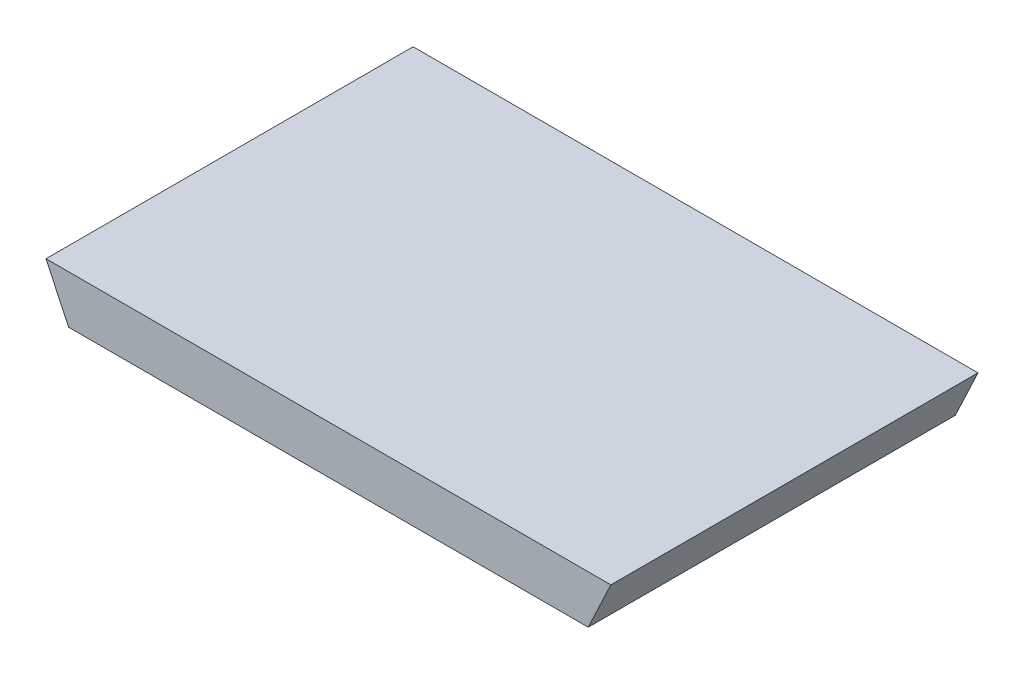
ISO-10303-21;
HEADER;
FILE_DESCRIPTION(('STEP AP214'),'2;1');
FILE_NAME('part.step','',(''),(''),'','','');
FILE_SCHEMA(('AUTOMOTIVE_DESIGN { 1 0 10303 214 1 1 1 1 }'));
ENDSEC;
DATA;
#1=APPLICATION_CONTEXT('core data for automotive mechanical design processes');
#2=APPLICATION_PROTOCOL_DEFINITION('international standard','automotive_design',2000,#1);
#3=PRODUCT_CONTEXT('',#1,'mechanical');
#4=PRODUCT('Part','Part','',(#3));
#5=PRODUCT_RELATED_PRODUCT_CATEGORY('part','',(#4));
#6=PRODUCT_DEFINITION_FORMATION('','',#4);
#7=PRODUCT_DEFINITION_CONTEXT('part definition',#1,'design');
#8=PRODUCT_DEFINITION('design','',#6,#7);
#9=PRODUCT_DEFINITION_SHAPE('','',#8);
#10=(LENGTH_UNIT() NAMED_UNIT(*) SI_UNIT(.MILLI.,.METRE.));
#11=(NAMED_UNIT(*) PLANE_ANGLE_UNIT() SI_UNIT($,.RADIAN.));
#12=(NAMED_UNIT(*) SI_UNIT($,.STERADIAN.) SOLID_ANGLE_UNIT());
#13=UNCERTAINTY_MEASURE_WITH_UNIT(LENGTH_MEASURE(1.E-05),#10,'distance_accuracy_value','');
#14=(GEOMETRIC_REPRESENTATION_CONTEXT(3) GLOBAL_UNCERTAINTY_ASSIGNED_CONTEXT((#13)) GLOBAL_UNIT_ASSIGNED_CONTEXT((#10,
#11,#12)) REPRESENTATION_CONTEXT('',''));
#15=CARTESIAN_POINT('',(0.,0.,0.));
#16=DIRECTION('',(0.,0.,1.));
#17=DIRECTION('',(1.,0.,0.));
#18=AXIS2_PLACEMENT_3D('',#15,#16,#17);
#19=CARTESIAN_POINT('',(0.9200007,-0.08499856,0.));
#20=DIRECTION('',(0.,-1.,0.));
#21=DIRECTION('',(0.,0.,-1.));
#22=AXIS2_PLACEMENT_3D('',#19,#20,#21);
#23=PLANE('',#22);
#24=DIRECTION('',(0.,0.,1.));
#25=VECTOR('',#24,1.);
#26=CARTESIAN_POINT('',(-0.9200007,-0.08499856,0.));
#27=LINE('',#26,#25);
#28=CARTESIAN_POINT('',(-0.9200007,-0.08499856,0.));
#29=VERTEX_POINT('',#28);
#30=CARTESIAN_POINT('',(-0.9200007,-0.08499856,1.29999994));
#31=VERTEX_POINT('',#30);
#32=EDGE_CURVE('E19',#29,#31,#27,.T.);
#33=ORIENTED_EDGE('',*,*,#32,.F.);
#34=DIRECTION('',(1.,0.,0.));
#35=VECTOR('',#34,1.);
#36=CARTESIAN_POINT('',(-1.00000054,-0.08499856,0.));
#37=LINE('',#36,#35);
#38=CARTESIAN_POINT('',(0.920000699999995,-0.0849985599999979,0.));
#39=VERTEX_POINT('',#38);
#40=EDGE_CURVE('E79',#29,#39,#37,.T.);
#41=ORIENTED_EDGE('',*,*,#40,.T.);
#42=DIRECTION('',(0.,0.,1.));
#43=VECTOR('',#42,1.);
#44=CARTESIAN_POINT('',(0.920000699999982,-0.0849985599999915,0.));
#45=LINE('',#44,#43);
#46=CARTESIAN_POINT('',(0.920000699999995,-0.0849985599999979,1.29999994));
#47=VERTEX_POINT('',#46);
#48=EDGE_CURVE('E67',#47,#39,#45,.F.);
#49=ORIENTED_EDGE('',*,*,#48,.F.);
#50=DIRECTION('',(1.,0.,0.));
#51=VECTOR('',#50,1.);
#52=CARTESIAN_POINT('',(-1.00000054,-0.08499856,1.29999994));
#53=LINE('',#52,#51);
#54=EDGE_CURVE('E55',#31,#47,#53,.T.);
#55=ORIENTED_EDGE('',*,*,#54,.F.);
#56=EDGE_LOOP('',(#33,#41,#49,#55));
#57=FACE_BOUND('',#56,.T.);
#58=ADVANCED_FACE('F16',(#57),#23,.T.);
#59=CARTESIAN_POINT('',(-0.9200007,-0.08499856,0.));
#60=DIRECTION('',(-0.904818702200949,-0.425797036329976,0.));
#61=DIRECTION('',(0.425797036329976,-0.904818702200949,0.));
#62=AXIS2_PLACEMENT_3D('',#59,#60,#61);
#63=PLANE('',#62);
#64=DIRECTION('',(0.,0.,1.));
#65=VECTOR('',#64,1.);
#66=CARTESIAN_POINT('',(-1.00000054,0.0850011,0.));
#67=LINE('',#66,#65);
#68=CARTESIAN_POINT('',(-1.00000054000001,0.0850010999999958,0.));
#69=VERTEX_POINT('',#68);
#70=CARTESIAN_POINT('',(-1.00000054000001,0.0850010999999958,1.29999994));
#71=VERTEX_POINT('',#70);
#72=EDGE_CURVE('E82',#69,#71,#67,.T.);
#73=ORIENTED_EDGE('',*,*,#72,.F.);
#74=DIRECTION('',(0.425797036329879,-0.904818702200994,0.));
#75=VECTOR('',#74,1.);
#76=CARTESIAN_POINT('',(-1.00000054,0.0850011,0.));
#77=LINE('',#76,#75);
#78=EDGE_CURVE('E64',#69,#29,#77,.T.);
#79=ORIENTED_EDGE('',*,*,#78,.T.);
#80=ORIENTED_EDGE('',*,*,#32,.T.);
#81=DIRECTION('',(0.425797036329879,-0.904818702200994,0.));
#82=VECTOR('',#81,1.);
#83=CARTESIAN_POINT('',(-1.00000054,0.0850011,1.29999994));
#84=LINE('',#83,#82);
#85=EDGE_CURVE('E61',#71,#31,#84,.T.);
#86=ORIENTED_EDGE('',*,*,#85,.F.);
#87=EDGE_LOOP('',(#73,#79,#80,#86));
#88=FACE_BOUND('',#87,.T.);
#89=ADVANCED_FACE('F60',(#88),#63,.T.);
#90=CARTESIAN_POINT('',(-1.00000054,0.0850011,1.29999994));
#91=DIRECTION('',(0.,0.,1.));
#92=DIRECTION('',(1.,0.,0.));
#93=AXIS2_PLACEMENT_3D('',#90,#91,#92);
#94=PLANE('',#93);
#95=DIRECTION('',(0.425797036329976,0.904818702200949,0.));
#96=VECTOR('',#95,1.);
#97=CARTESIAN_POINT('',(1.00000054,0.0850011,1.29999994));
#98=LINE('',#97,#96);
#99=CARTESIAN_POINT('',(1.00000054,0.0850011,1.29999994));
#100=VERTEX_POINT('',#99);
#101=EDGE_CURVE('E69',#100,#47,#98,.F.);
#102=ORIENTED_EDGE('',*,*,#101,.F.);
#103=DIRECTION('',(1.,0.,0.));
#104=VECTOR('',#103,1.);
#105=CARTESIAN_POINT('',(-1.00000054,0.0850011,1.29999994));
#106=LINE('',#105,#104);
#107=EDGE_CURVE('E73',#71,#100,#106,.T.);
#108=ORIENTED_EDGE('',*,*,#107,.F.);
#109=ORIENTED_EDGE('',*,*,#85,.T.);
#110=ORIENTED_EDGE('',*,*,#54,.T.);
#111=EDGE_LOOP('',(#102,#108,#109,#110));
#112=FACE_BOUND('',#111,.T.);
#113=ADVANCED_FACE('F71',(#112),#94,.T.);
#114=CARTESIAN_POINT('',(1.00000054,0.0850011,0.));
#115=DIRECTION('',(0.904818702200949,-0.425797036329976,0.));
#116=DIRECTION('',(0.425797036329976,0.904818702200949,0.));
#117=AXIS2_PLACEMENT_3D('',#114,#115,#116);
#118=PLANE('',#117);
#119=ORIENTED_EDGE('',*,*,#48,.T.);
#120=DIRECTION('',(0.425797036329879,0.904818702200994,0.));
#121=VECTOR('',#120,1.);
#122=CARTESIAN_POINT('',(0.9200007,-0.08499856,0.));
#123=LINE('',#122,#121);
#124=CARTESIAN_POINT('',(1.00000054,0.0850011,0.));
#125=VERTEX_POINT('',#124);
#126=EDGE_CURVE('E34',#39,#125,#123,.T.);
#127=ORIENTED_EDGE('',*,*,#126,.T.);
#128=DIRECTION('',(0.,0.,1.));
#129=VECTOR('',#128,1.);
#130=CARTESIAN_POINT('',(1.00000054,0.0850011,0.));
#131=LINE('',#130,#129);
#132=EDGE_CURVE('E25',#100,#125,#131,.F.);
#133=ORIENTED_EDGE('',*,*,#132,.F.);
#134=ORIENTED_EDGE('',*,*,#101,.T.);
#135=EDGE_LOOP('',(#119,#127,#133,#134));
#136=FACE_BOUND('',#135,.T.);
#137=ADVANCED_FACE('F88',(#136),#118,.T.);
#138=CARTESIAN_POINT('',(-1.00000054,0.0850011,0.));
#139=DIRECTION('',(0.,0.,1.));
#140=DIRECTION('',(1.,0.,0.));
#141=AXIS2_PLACEMENT_3D('',#138,#139,#140);
#142=PLANE('',#141);
#143=ORIENTED_EDGE('',*,*,#126,.F.);
#144=ORIENTED_EDGE('',*,*,#40,.F.);
#145=ORIENTED_EDGE('',*,*,#78,.F.);
#146=DIRECTION('',(1.,0.,0.));
#147=VECTOR('',#146,1.);
#148=CARTESIAN_POINT('',(-1.00000054,0.0850011,0.));
#149=LINE('',#148,#147);
#150=EDGE_CURVE('E11',#125,#69,#149,.F.);
#151=ORIENTED_EDGE('',*,*,#150,.F.);
#152=EDGE_LOOP('',(#143,#144,#145,#151));
#153=FACE_BOUND('',#152,.T.);
#154=ADVANCED_FACE('F90',(#153),#142,.F.);
#155=CARTESIAN_POINT('',(-1.00000054,0.0850011,0.));
#156=DIRECTION('',(0.,1.,0.));
#157=DIRECTION('',(0.,0.,1.));
#158=AXIS2_PLACEMENT_3D('',#155,#156,#157);
#159=PLANE('',#158);
#160=ORIENTED_EDGE('',*,*,#132,.T.);
#161=ORIENTED_EDGE('',*,*,#150,.T.);
#162=ORIENTED_EDGE('',*,*,#72,.T.);
#163=ORIENTED_EDGE('',*,*,#107,.T.);
#164=EDGE_LOOP('',(#160,#161,#162,#163));
#165=FACE_BOUND('',#164,.T.);
#166=ADVANCED_FACE('F87',(#165),#159,.T.);
#167=CLOSED_SHELL('',(#58,#89,#113,#137,#154,#166));
#168=MANIFOLD_SOLID_BREP('B1',#167);
#169=ADVANCED_BREP_SHAPE_REPRESENTATION('',(#18,#168),#14);
#170=SHAPE_DEFINITION_REPRESENTATION(#9,#169);
ENDSEC;
END-ISO-10303-21;
